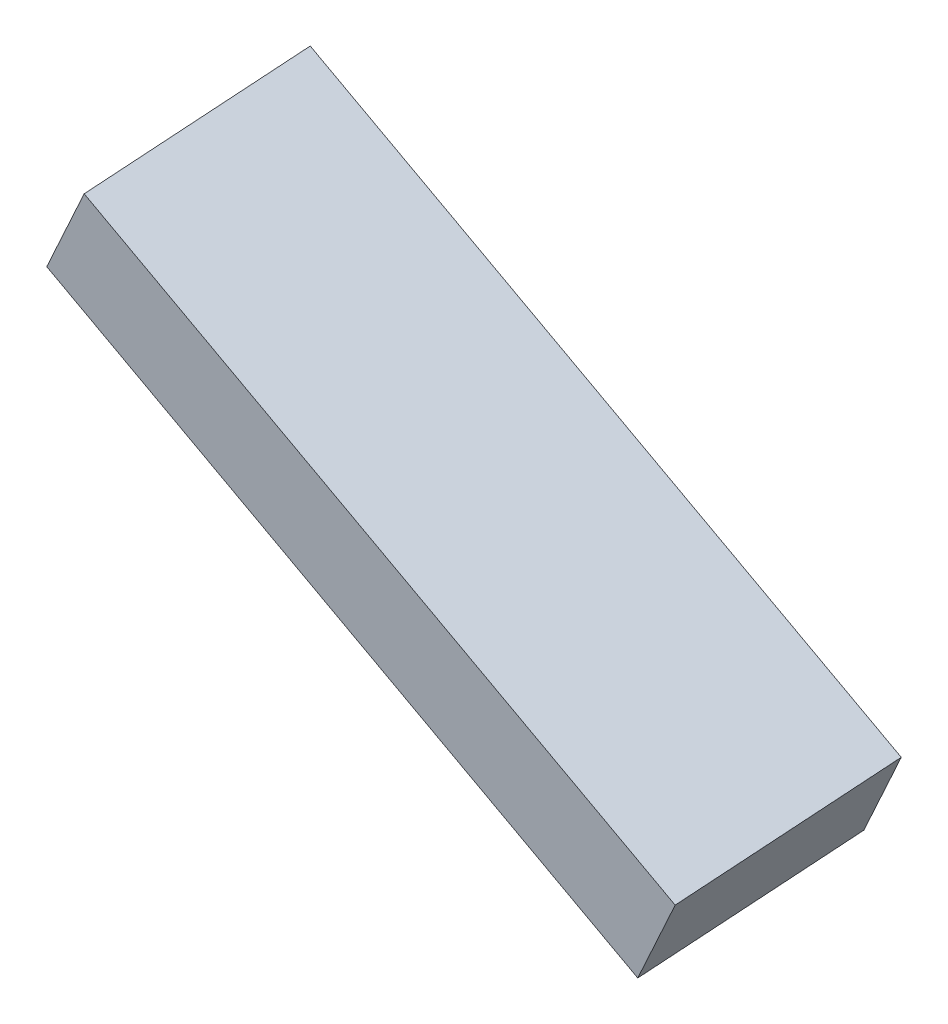
ISO-10303-21;
HEADER;
FILE_DESCRIPTION(('STEP AP214'),'2;1');
FILE_NAME('part.step','',(''),(''),'','','');
FILE_SCHEMA(('AUTOMOTIVE_DESIGN { 1 0 10303 214 1 1 1 1 }'));
ENDSEC;
DATA;
#1=APPLICATION_CONTEXT('core data for automotive mechanical design processes');
#2=APPLICATION_PROTOCOL_DEFINITION('international standard','automotive_design',2000,#1);
#3=PRODUCT_CONTEXT('',#1,'mechanical');
#4=PRODUCT('Part','Part','',(#3));
#5=PRODUCT_RELATED_PRODUCT_CATEGORY('part','',(#4));
#6=PRODUCT_DEFINITION_FORMATION('','',#4);
#7=PRODUCT_DEFINITION_CONTEXT('part definition',#1,'design');
#8=PRODUCT_DEFINITION('design','',#6,#7);
#9=PRODUCT_DEFINITION_SHAPE('','',#8);
#10=(LENGTH_UNIT() NAMED_UNIT(*) SI_UNIT(.MILLI.,.METRE.));
#11=(NAMED_UNIT(*) PLANE_ANGLE_UNIT() SI_UNIT($,.RADIAN.));
#12=(NAMED_UNIT(*) SI_UNIT($,.STERADIAN.) SOLID_ANGLE_UNIT());
#13=UNCERTAINTY_MEASURE_WITH_UNIT(LENGTH_MEASURE(1.E-05),#10,'distance_accuracy_value','');
#14=(GEOMETRIC_REPRESENTATION_CONTEXT(3) GLOBAL_UNCERTAINTY_ASSIGNED_CONTEXT((#13)) GLOBAL_UNIT_ASSIGNED_CONTEXT((#10,
#11,#12)) REPRESENTATION_CONTEXT('',''));
#15=CARTESIAN_POINT('',(0.,0.,0.));
#16=DIRECTION('',(0.,0.,1.));
#17=DIRECTION('',(1.,0.,0.));
#18=AXIS2_PLACEMENT_3D('',#15,#16,#17);
#19=CARTESIAN_POINT('',(5.6901451310808,7.82705030350138,-2.76781068212118));
#20=DIRECTION('',(-0.0700467867817382,-0.140031094997194,0.987666310094376));
#21=DIRECTION('',(-0.894347369424562,0.447373203045696,0.));
#22=AXIS2_PLACEMENT_3D('',#19,#20,#21);
#23=PLANE('',#22);
#24=DIRECTION('',(0.479603965309405,0.863428854211439,0.15643097575166));
#25=VECTOR('',#24,1.);
#26=CARTESIAN_POINT('',(3.68313780458883,8.46862751606835,-2.8191880088078));
#27=LINE('',#26,#25);
#28=CARTESIAN_POINT('',(3.68313780458883,8.46862751606835,-2.8191880088078));
#29=VERTEX_POINT('',#28);
#30=CARTESIAN_POINT('',(3.85418827105452,8.77656889886634,-2.76339699516056));
#31=VERTEX_POINT('',#30);
#32=EDGE_CURVE('E11',#29,#31,#27,.T.);
#33=ORIENTED_EDGE('',*,*,#32,.T.);
#34=DIRECTION('',(0.874684791294012,-0.484646165928307,-0.00667905157512309));
#35=VECTOR('',#34,1.);
#36=CARTESIAN_POINT('',(3.85418827105452,8.77656889886634,-2.76339699516056));
#37=LINE('',#36,#35);
#38=CARTESIAN_POINT('',(5.66136889316259,7.77524457224933,-2.77719654066628));
#39=VERTEX_POINT('',#38);
#40=EDGE_CURVE('E46',#31,#39,#37,.T.);
#41=ORIENTED_EDGE('',*,*,#40,.T.);
#42=DIRECTION('',(0.479603965309405,0.863428854211439,0.15643097575166));
#43=VECTOR('',#42,1.);
#44=CARTESIAN_POINT('',(5.49031842669691,7.46730318945135,-2.83298755431352));
#45=LINE('',#44,#43);
#46=CARTESIAN_POINT('',(5.49031842669691,7.46730318945135,-2.83298755431352));
#47=VERTEX_POINT('',#46);
#48=EDGE_CURVE('E70',#47,#39,#45,.T.);
#49=ORIENTED_EDGE('',*,*,#48,.F.);
#50=DIRECTION('',(-0.874684791294012,0.484646165928307,0.00667905157512309));
#51=VECTOR('',#50,1.);
#52=CARTESIAN_POINT('',(5.49031842669691,7.46730318945135,-2.83298755431352));
#53=LINE('',#52,#51);
#54=EDGE_CURVE('E68',#47,#29,#53,.T.);
#55=ORIENTED_EDGE('',*,*,#54,.T.);
#56=EDGE_LOOP('',(#33,#41,#49,#55));
#57=FACE_BOUND('',#56,.T.);
#58=ADVANCED_FACE('F17',(#57),#23,.F.);
#59=CARTESIAN_POINT('',(3.88296450897273,8.82837463011838,-2.75401113661546));
#60=DIRECTION('',(0.874684791294012,-0.484646165928307,-0.00667905157512309));
#61=DIRECTION('',(0.,0.0137799860570426,-0.999905051484524));
#62=AXIS2_PLACEMENT_3D('',#59,#60,#61);
#63=PLANE('',#62);
#64=DIRECTION('',(-0.479603965309405,-0.863428854211439,-0.15643097575166));
#65=VECTOR('',#64,1.);
#66=CARTESIAN_POINT('',(3.80806100306295,8.68435550632036,-2.11299815939551));
#67=LINE('',#66,#65);
#68=CARTESIAN_POINT('',(3.80806100306295,8.68435550632036,-2.11299815939551));
#69=VERTEX_POINT('',#68);
#70=CARTESIAN_POINT('',(3.63701053659774,8.37641412352325,-2.16878917304276));
#71=VERTEX_POINT('',#70);
#72=EDGE_CURVE('E86',#69,#71,#67,.T.);
#73=ORIENTED_EDGE('',*,*,#72,.F.);
#74=DIRECTION('',(0.0700467867817382,0.140031094997194,-0.987666310094376));
#75=VECTOR('',#74,1.);
#76=CARTESIAN_POINT('',(3.80806100306295,8.68435550632036,-2.11299815939551));
#77=LINE('',#76,#75);
#78=EDGE_CURVE('E26',#69,#31,#77,.T.);
#79=ORIENTED_EDGE('',*,*,#78,.T.);
#80=ORIENTED_EDGE('',*,*,#32,.F.);
#81=DIRECTION('',(-0.0700467867817382,-0.140031094997194,0.987666310094376));
#82=VECTOR('',#81,1.);
#83=CARTESIAN_POINT('',(3.68313780458883,8.46862751606835,-2.8191880088078));
#84=LINE('',#83,#82);
#85=EDGE_CURVE('E65',#29,#71,#84,.T.);
#86=ORIENTED_EDGE('',*,*,#85,.T.);
#87=EDGE_LOOP('',(#73,#79,#80,#86));
#88=FACE_BOUND('',#87,.T.);
#89=ADVANCED_FACE('F19',(#88),#63,.F.);
#90=CARTESIAN_POINT('',(5.16484772035367,7.99110262627161,-2.44634486098146));
#91=DIRECTION('',(0.479603965309405,0.863428854211439,0.15643097575166));
#92=DIRECTION('',(0.310089363611885,0.,-0.950707413758185));
#93=AXIS2_PLACEMENT_3D('',#90,#91,#92);
#94=PLANE('',#93);
#95=DIRECTION('',(-0.0700467867817382,-0.140031094997194,0.987666310094376));
#96=VECTOR('',#95,1.);
#97=CARTESIAN_POINT('',(5.66136889316259,7.77524457224933,-2.77719654066628));
#98=LINE('',#97,#96);
#99=CARTESIAN_POINT('',(5.61524162517102,7.68303117970336,-2.12679770490123));
#100=VERTEX_POINT('',#99);
#101=EDGE_CURVE('E89',#39,#100,#98,.T.);
#102=ORIENTED_EDGE('',*,*,#101,.F.);
#103=ORIENTED_EDGE('',*,*,#40,.F.);
#104=ORIENTED_EDGE('',*,*,#78,.F.);
#105=DIRECTION('',(-0.874684791294012,0.484646165928307,0.00667905157512309));
#106=VECTOR('',#105,1.);
#107=CARTESIAN_POINT('',(5.61524162517102,7.68303117970336,-2.12679770490123));
#108=LINE('',#107,#106);
#109=EDGE_CURVE('E109',#100,#69,#108,.T.);
#110=ORIENTED_EDGE('',*,*,#109,.F.);
#111=EDGE_LOOP('',(#102,#103,#104,#110));
#112=FACE_BOUND('',#111,.T.);
#113=ADVANCED_FACE('F110',(#112),#94,.T.);
#114=CARTESIAN_POINT('',(5.64401786308971,7.73483691095628,-2.11741184635615));
#115=DIRECTION('',(-0.874684791294012,0.484646165928307,0.00667905157512309));
#116=DIRECTION('',(0.00763572995644576,0.,0.999970847389079));
#117=AXIS2_PLACEMENT_3D('',#114,#115,#116);
#118=PLANE('',#117);
#119=ORIENTED_EDGE('',*,*,#48,.T.);
#120=ORIENTED_EDGE('',*,*,#101,.T.);
#121=DIRECTION('',(0.479603965309398,0.863428854211426,0.156430975751757));
#122=VECTOR('',#121,1.);
#123=CARTESIAN_POINT('',(5.44419115870581,7.37508979690625,-2.18258871854848));
#124=LINE('',#123,#122);
#125=CARTESIAN_POINT('',(5.44419115870581,7.37508979690625,-2.18258871854848));
#126=VERTEX_POINT('',#125);
#127=EDGE_CURVE('E106',#126,#100,#124,.T.);
#128=ORIENTED_EDGE('',*,*,#127,.F.);
#129=DIRECTION('',(0.0700467867817382,0.140031094997194,-0.987666310094376));
#130=VECTOR('',#129,1.);
#131=CARTESIAN_POINT('',(5.44419115870581,7.37508979690625,-2.18258871854848));
#132=LINE('',#131,#130);
#133=EDGE_CURVE('E75',#126,#47,#132,.T.);
#134=ORIENTED_EDGE('',*,*,#133,.T.);
#135=EDGE_LOOP('',(#119,#120,#128,#134));
#136=FACE_BOUND('',#135,.T.);
#137=ADVANCED_FACE('F103',(#136),#118,.F.);
#138=CARTESIAN_POINT('',(4.99379725388813,7.68316124347374,-2.5021358746187));
#139=DIRECTION('',(0.479603965309405,0.863428854211439,0.15643097575166));
#140=DIRECTION('',(0.310089363611885,0.,-0.950707413758185));
#141=AXIS2_PLACEMENT_3D('',#138,#139,#140);
#142=PLANE('',#141);
#143=ORIENTED_EDGE('',*,*,#85,.F.);
#144=ORIENTED_EDGE('',*,*,#54,.F.);
#145=ORIENTED_EDGE('',*,*,#133,.F.);
#146=DIRECTION('',(0.874684791294012,-0.484646165928307,-0.00667905157512309));
#147=VECTOR('',#146,1.);
#148=CARTESIAN_POINT('',(3.63701053659774,8.37641412352325,-2.16878917304276));
#149=LINE('',#148,#147);
#150=EDGE_CURVE('E79',#71,#126,#149,.T.);
#151=ORIENTED_EDGE('',*,*,#150,.F.);
#152=EDGE_LOOP('',(#143,#144,#145,#151));
#153=FACE_BOUND('',#152,.T.);
#154=ADVANCED_FACE('F77',(#153),#142,.F.);
#155=CARTESIAN_POINT('',(3.83683724098164,8.73616123757328,-2.10361230085043));
#156=DIRECTION('',(0.0700467867817382,0.140031094997194,-0.987666310094376));
#157=DIRECTION('',(-0.997494517379451,0.,-0.0707438180898919));
#158=AXIS2_PLACEMENT_3D('',#155,#156,#157);
#159=PLANE('',#158);
#160=ORIENTED_EDGE('',*,*,#127,.T.);
#161=ORIENTED_EDGE('',*,*,#109,.T.);
#162=ORIENTED_EDGE('',*,*,#72,.T.);
#163=ORIENTED_EDGE('',*,*,#150,.T.);
#164=EDGE_LOOP('',(#160,#161,#162,#163));
#165=FACE_BOUND('',#164,.T.);
#166=ADVANCED_FACE('F114',(#165),#159,.F.);
#167=CLOSED_SHELL('',(#58,#89,#113,#137,#154,#166));
#168=MANIFOLD_SOLID_BREP('B1',#167);
#169=ADVANCED_BREP_SHAPE_REPRESENTATION('',(#18,#168),#14);
#170=SHAPE_DEFINITION_REPRESENTATION(#9,#169);
ENDSEC;
END-ISO-10303-21;
